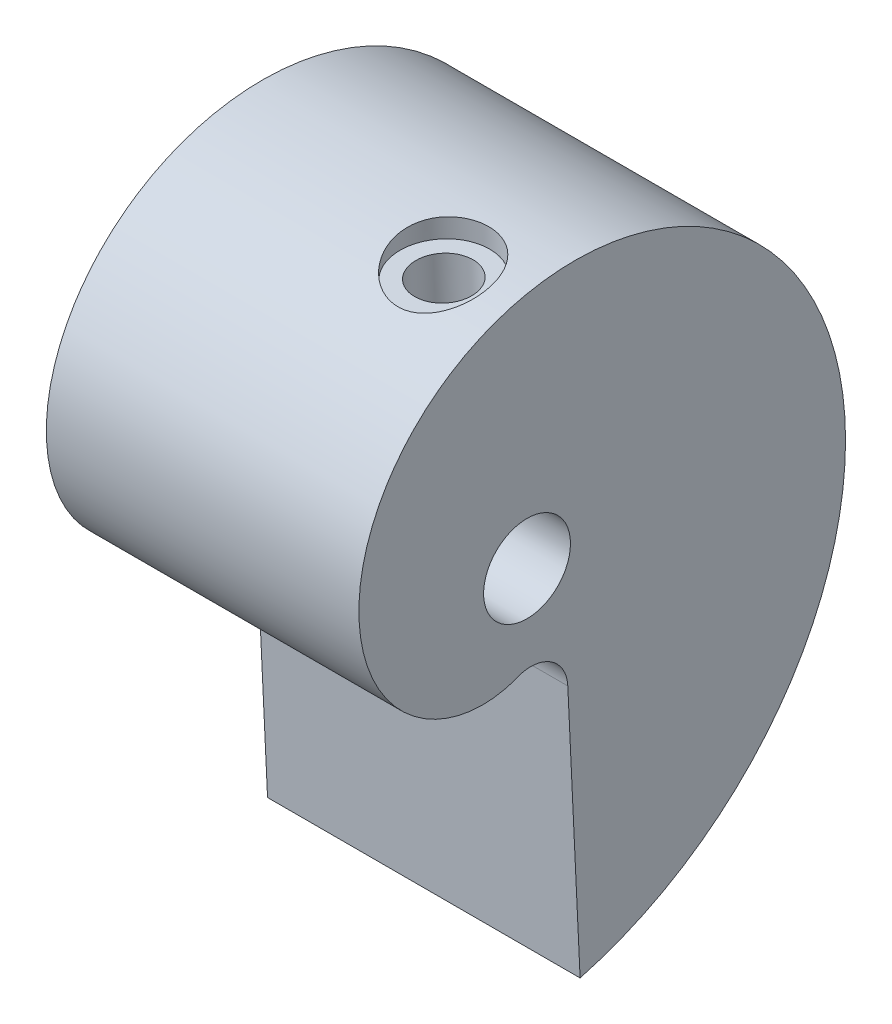
ISO-10303-21;
HEADER;
FILE_DESCRIPTION(('STEP AP214'),'2;1');
FILE_NAME('part.step','',(''),(''),'','','');
FILE_SCHEMA(('AUTOMOTIVE_DESIGN { 1 0 10303 214 1 1 1 1 }'));
ENDSEC;
DATA;
#1=APPLICATION_CONTEXT('core data for automotive mechanical design processes');
#2=APPLICATION_PROTOCOL_DEFINITION('international standard','automotive_design',2000,#1);
#3=PRODUCT_CONTEXT('',#1,'mechanical');
#4=PRODUCT('Part','Part','',(#3));
#5=PRODUCT_RELATED_PRODUCT_CATEGORY('part','',(#4));
#6=PRODUCT_DEFINITION_FORMATION('','',#4);
#7=PRODUCT_DEFINITION_CONTEXT('part definition',#1,'design');
#8=PRODUCT_DEFINITION('design','',#6,#7);
#9=PRODUCT_DEFINITION_SHAPE('','',#8);
#10=(LENGTH_UNIT() NAMED_UNIT(*) SI_UNIT(.MILLI.,.METRE.));
#11=(NAMED_UNIT(*) PLANE_ANGLE_UNIT() SI_UNIT($,.RADIAN.));
#12=(NAMED_UNIT(*) SI_UNIT($,.STERADIAN.) SOLID_ANGLE_UNIT());
#13=UNCERTAINTY_MEASURE_WITH_UNIT(LENGTH_MEASURE(1.E-05),#10,'distance_accuracy_value','');
#14=(GEOMETRIC_REPRESENTATION_CONTEXT(3) GLOBAL_UNCERTAINTY_ASSIGNED_CONTEXT((#13)) GLOBAL_UNIT_ASSIGNED_CONTEXT((#10,
#11,#12)) REPRESENTATION_CONTEXT('',''));
#15=CARTESIAN_POINT('',(0.,0.,0.));
#16=DIRECTION('',(0.,0.,1.));
#17=DIRECTION('',(1.,0.,0.));
#18=AXIS2_PLACEMENT_3D('',#15,#16,#17);
#19=CARTESIAN_POINT('',(21.59,16.3980040897592,0.208936694079273));
#20=DIRECTION('',(1.,0.,0.));
#21=DIRECTION('',(0.,0.,-1.));
#22=AXIS2_PLACEMENT_3D('',#19,#20,#21);
#23=PLANE('',#22);
#24=CARTESIAN_POINT('',(21.59,-26.3254834999288,-3.66701312597946));
#25=CARTESIAN_POINT('',(21.59,-25.8850164099486,-5.29183143138332));
#26=CARTESIAN_POINT('',(21.59,-25.2937709802203,-6.85500985861185));
#27=CARTESIAN_POINT('',(21.59,-23.8451939849136,-9.80629411018198));
#28=CARTESIAN_POINT('',(21.59,-22.9879265697091,-11.1943493778112));
#29=CARTESIAN_POINT('',(21.59,-21.0514010056648,-13.7523524342122));
#30=CARTESIAN_POINT('',(21.59,-19.9722145165317,-14.9222640436458));
#31=CARTESIAN_POINT('',(21.59,-17.6424148443339,-17.0111362692066));
#32=CARTESIAN_POINT('',(21.59,-16.3918777440894,-17.9300760548234));
#33=CARTESIAN_POINT('',(21.59,-13.774181132005,-19.4952108297215));
#34=CARTESIAN_POINT('',(21.59,-12.4070989510175,-20.1414006679111));
#35=CARTESIAN_POINT('',(21.59,-9.61304301680638,-21.1506818581234));
#36=CARTESIAN_POINT('',(21.59,-8.18614470800054,-21.5137834309209));
#37=CARTESIAN_POINT('',(21.59,-5.3288100875924,-21.9578966574969));
#38=CARTESIAN_POINT('',(21.59,-3.8984443651538,-22.038932986476));
#39=CARTESIAN_POINT('',(21.59,-1.08794928189315,-21.9307589450492));
#40=CARTESIAN_POINT('',(21.59,0.292117032528461,-21.7415862291151));
#41=CARTESIAN_POINT('',(21.59,2.95283289615589,-21.1147307327981));
#42=CARTESIAN_POINT('',(21.59,4.23342924609723,-20.6770966268396));
#43=CARTESIAN_POINT('',(21.59,6.65237105198453,-19.5836453555955));
#44=CARTESIAN_POINT('',(21.59,7.79067499289227,-18.9278855327687));
#45=CARTESIAN_POINT('',(21.59,9.88997156551444,-17.4355003933537));
#46=CARTESIAN_POINT('',(21.59,10.8509356728284,-16.5989384482919));
#47=CARTESIAN_POINT('',(21.59,12.5693210600784,-14.7874359048066));
#48=CARTESIAN_POINT('',(21.59,13.3267275415238,-13.8125618959728));
#49=CARTESIAN_POINT('',(21.59,14.6212472227952,-11.7701307863269));
#50=CARTESIAN_POINT('',(21.59,15.1583594978757,-10.7026406297588));
#51=CARTESIAN_POINT('',(21.59,16.0052572395325,-8.52186727257846));
#52=CARTESIAN_POINT('',(21.59,16.3150552236039,-7.40864857435838));
#53=CARTESIAN_POINT('',(21.59,16.7098316537026,-5.1825201174866));
#54=CARTESIAN_POINT('',(21.59,16.7948350803545,-4.06966980389498));
#55=CARTESIAN_POINT('',(21.59,16.7515036458065,-1.88772278855217));
#56=CARTESIAN_POINT('',(21.59,16.6232047553048,-0.818678144435623));
#57=CARTESIAN_POINT('',(21.59,16.1728034242135,1.23655153259428));
#58=CARTESIAN_POINT('',(21.59,15.8507460504129,2.22269384951727));
#59=CARTESIAN_POINT('',(21.59,15.0391926205608,4.07878041726697));
#60=CARTESIAN_POINT('',(21.59,14.5497485015278,4.94869279896394));
#61=CARTESIAN_POINT('',(21.59,13.4351525169527,6.5458728071125));
#62=CARTESIAN_POINT('',(21.59,12.8100570020662,7.27312041446994));
#63=CARTESIAN_POINT('',(21.59,11.4596211058448,8.56619770795014));
#64=CARTESIAN_POINT('',(21.59,10.7343389103516,9.13201969506656));
#65=CARTESIAN_POINT('',(21.59,8.46432492032774,10.5713349527582));
#66=CARTESIAN_POINT('',(21.59,6.82631034463374,11.1827796887629));
#67=CARTESIAN_POINT('',(21.59,3.59680348317033,11.7204279571445));
#68=CARTESIAN_POINT('',(21.59,2.00685947245538,11.6474809761802));
#69=CARTESIAN_POINT('',(21.59,-0.874358563474903,10.9424993264994));
#70=CARTESIAN_POINT('',(21.59,-2.16461256267651,10.3118298030999));
#71=CARTESIAN_POINT('',(21.59,-4.28109326467022,8.69840573541426));
#72=CARTESIAN_POINT('',(21.59,-5.10697539238301,7.71726162806799));
#73=CARTESIAN_POINT('',(21.59,-6.23707693613607,5.64499605846387));
#74=CARTESIAN_POINT('',(21.59,-6.54165034000696,4.55542957813348));
#75=CARTESIAN_POINT('',(21.59,-6.67904709626705,2.49487199667444));
#76=CARTESIAN_POINT('',(21.59,-6.51282232630776,1.52510200770759));
#77=CARTESIAN_POINT('',(21.59,-6.17940617515592,0.700777065763977));
#78=B_SPLINE_CURVE_WITH_KNOTS('',3,(#24,#25,#26,#27,#28,#29,#30,#31,#32,#33,#34,#35,#36,#37,#38,
#39,#40,#41,#42,#43,#44,#45,#46,#47,#48,#49,#50,#51,#52,#53,#54,#55,#56,#57,#58,#59,#60,#61,#62,
#63,#64,#65,#66,#67,#68,#69,#70,#71,#72,#73,#74,#75,#76,#77),.UNSPECIFIED.,.F.,.F.,(4,2,2,2,2,2,
2,2,2,2,2,2,2,2,2,2,2,2,2,2,2,2,2,2,2,2,4),(0.,0.0312500000000001,0.0625000000000001,
0.0937500000000002,0.125,0.15625,0.1875,0.218750000000001,0.250000000000001,0.281250000000001,
0.312500000000001,0.343750000000001,0.375000000000001,0.406250000000001,0.437500000000001,
0.468750000000001,0.500000000000001,0.53125,0.5625,0.59375,0.625,0.6875,0.75,0.8125,0.875,
0.9375,1.),.UNSPECIFIED.);
#79=CARTESIAN_POINT('',(21.59,-26.3254834999288,-3.66701312597946));
#80=VERTEX_POINT('',#79);
#81=CARTESIAN_POINT('',(21.59,-6.17940617515592,0.700777065763977));
#82=VERTEX_POINT('',#81);
#83=EDGE_CURVE('E96',#80,#82,#78,.T.);
#84=ORIENTED_EDGE('',*,*,#83,.T.);
#85=CARTESIAN_POINT('',(21.59,-8.55278837318837,-0.259188983321581));
#86=DIRECTION('',(-1.,0.,0.));
#87=DIRECTION('',(0.,0.,-1.));
#88=AXIS2_PLACEMENT_3D('',#85,#86,#87);
#89=CIRCLE('',#88,2.56017145389411);
#90=CARTESIAN_POINT('',(21.59,-8.4312368938815,-2.81647330682036));
#91=VERTEX_POINT('',#90);
#92=EDGE_CURVE('E92',#82,#91,#89,.T.);
#93=ORIENTED_EDGE('',*,*,#92,.T.);
#94=DIRECTION('',(0.,-0.998872290216758,-0.0474778668131734));
#95=VECTOR('',#94,1.);
#96=CARTESIAN_POINT('',(21.59,-26.3254834999288,-3.66701312597946));
#97=LINE('',#96,#95);
#98=EDGE_CURVE('E72',#91,#80,#97,.T.);
#99=ORIENTED_EDGE('',*,*,#98,.T.);
#100=EDGE_LOOP('',(#84,#93,#99));
#101=FACE_BOUND('',#100,.T.);
#102=CARTESIAN_POINT('',(21.59,0.,0.));
#103=DIRECTION('',(1.,0.,0.));
#104=DIRECTION('',(0.,0.,-1.));
#105=AXIS2_PLACEMENT_3D('',#102,#103,#104);
#106=CIRCLE('',#105,3.);
#107=CARTESIAN_POINT('',(21.59,0.,-3.));
#108=VERTEX_POINT('',#107);
#109=EDGE_CURVE('E105',#108,#108,#106,.T.);
#110=ORIENTED_EDGE('',*,*,#109,.F.);
#111=EDGE_LOOP('',(#110));
#112=FACE_BOUND('',#111,.T.);
#113=ADVANCED_FACE('F47',(#101,#112),#23,.T.);
#114=CARTESIAN_POINT('',(0.,16.3980040897592,0.208936694079273));
#115=DIRECTION('',(1.,0.,0.));
#116=DIRECTION('',(0.,0.,-1.));
#117=AXIS2_PLACEMENT_3D('',#114,#115,#116);
#118=PLANE('',#117);
#119=CARTESIAN_POINT('',(0.,-26.3254834999288,-3.66701312597946));
#120=CARTESIAN_POINT('',(0.,-25.8850164099486,-5.29183143138332));
#121=CARTESIAN_POINT('',(0.,-25.2937709802203,-6.85500985861185));
#122=CARTESIAN_POINT('',(0.,-23.8451939849136,-9.80629411018198));
#123=CARTESIAN_POINT('',(0.,-22.9879265697091,-11.1943493778112));
#124=CARTESIAN_POINT('',(0.,-21.0514010056648,-13.7523524342122));
#125=CARTESIAN_POINT('',(0.,-19.9722145165317,-14.9222640436458));
#126=CARTESIAN_POINT('',(0.,-17.6424148443339,-17.0111362692066));
#127=CARTESIAN_POINT('',(0.,-16.3918777440894,-17.9300760548234));
#128=CARTESIAN_POINT('',(0.,-13.774181132005,-19.4952108297215));
#129=CARTESIAN_POINT('',(0.,-12.4070989510175,-20.1414006679111));
#130=CARTESIAN_POINT('',(0.,-9.61304301680638,-21.1506818581234));
#131=CARTESIAN_POINT('',(0.,-8.18614470800054,-21.5137834309209));
#132=CARTESIAN_POINT('',(0.,-5.3288100875924,-21.9578966574969));
#133=CARTESIAN_POINT('',(0.,-3.8984443651538,-22.038932986476));
#134=CARTESIAN_POINT('',(0.,-1.08794928189315,-21.9307589450492));
#135=CARTESIAN_POINT('',(0.,0.292117032528461,-21.7415862291151));
#136=CARTESIAN_POINT('',(0.,2.95283289615589,-21.1147307327981));
#137=CARTESIAN_POINT('',(0.,4.23342924609723,-20.6770966268396));
#138=CARTESIAN_POINT('',(0.,6.65237105198453,-19.5836453555955));
#139=CARTESIAN_POINT('',(0.,7.79067499289227,-18.9278855327687));
#140=CARTESIAN_POINT('',(0.,9.88997156551444,-17.4355003933537));
#141=CARTESIAN_POINT('',(0.,10.8509356728284,-16.5989384482919));
#142=CARTESIAN_POINT('',(0.,12.5693210600784,-14.7874359048066));
#143=CARTESIAN_POINT('',(0.,13.3267275415238,-13.8125618959728));
#144=CARTESIAN_POINT('',(0.,14.6212472227952,-11.7701307863269));
#145=CARTESIAN_POINT('',(0.,15.1583594978757,-10.7026406297588));
#146=CARTESIAN_POINT('',(0.,16.0052572395325,-8.52186727257846));
#147=CARTESIAN_POINT('',(0.,16.3150552236039,-7.40864857435838));
#148=CARTESIAN_POINT('',(0.,16.7098316537026,-5.1825201174866));
#149=CARTESIAN_POINT('',(0.,16.7948350803545,-4.06966980389498));
#150=CARTESIAN_POINT('',(0.,16.7515036458065,-1.88772278855217));
#151=CARTESIAN_POINT('',(0.,16.6232047553048,-0.818678144435623));
#152=CARTESIAN_POINT('',(0.,16.1728034242135,1.23655153259428));
#153=CARTESIAN_POINT('',(0.,15.8507460504129,2.22269384951727));
#154=CARTESIAN_POINT('',(0.,15.0391926205608,4.07878041726697));
#155=CARTESIAN_POINT('',(0.,14.5497485015278,4.94869279896394));
#156=CARTESIAN_POINT('',(0.,13.4351525169527,6.5458728071125));
#157=CARTESIAN_POINT('',(0.,12.8100570020662,7.27312041446994));
#158=CARTESIAN_POINT('',(0.,11.4596211058448,8.56619770795014));
#159=CARTESIAN_POINT('',(0.,10.7343389103516,9.13201969506656));
#160=CARTESIAN_POINT('',(0.,8.46432492032774,10.5713349527582));
#161=CARTESIAN_POINT('',(0.,6.82631034463374,11.1827796887629));
#162=CARTESIAN_POINT('',(0.,3.59680348317033,11.7204279571445));
#163=CARTESIAN_POINT('',(0.,2.00685947245538,11.6474809761802));
#164=CARTESIAN_POINT('',(0.,-0.874358563474903,10.9424993264994));
#165=CARTESIAN_POINT('',(0.,-2.16461256267651,10.3118298030999));
#166=CARTESIAN_POINT('',(0.,-4.28109326467022,8.69840573541426));
#167=CARTESIAN_POINT('',(0.,-5.10697539238301,7.71726162806799));
#168=CARTESIAN_POINT('',(0.,-6.23707693613607,5.64499605846387));
#169=CARTESIAN_POINT('',(0.,-6.54165034000696,4.55542957813348));
#170=CARTESIAN_POINT('',(0.,-6.67904709626705,2.49487199667444));
#171=CARTESIAN_POINT('',(0.,-6.51282232630776,1.52510200770759));
#172=CARTESIAN_POINT('',(0.,-6.17940617515592,0.700777065763977));
#173=B_SPLINE_CURVE_WITH_KNOTS('',3,(#119,#120,#121,#122,#123,#124,#125,#126,#127,#128,#129,
#130,#131,#132,#133,#134,#135,#136,#137,#138,#139,#140,#141,#142,#143,#144,#145,#146,#147,#148,
#149,#150,#151,#152,#153,#154,#155,#156,#157,#158,#159,#160,#161,#162,#163,#164,#165,#166,#167,
#168,#169,#170,#171,#172),.UNSPECIFIED.,.F.,.F.,(4,2,2,2,2,2,2,2,2,2,2,2,2,2,2,2,2,2,2,2,2,2,2,
2,2,2,4),(0.,0.0312500000000001,0.0625000000000001,0.0937500000000002,0.125,0.15625,0.1875,
0.218750000000001,0.250000000000001,0.281250000000001,0.312500000000001,0.343750000000001,
0.375000000000001,0.406250000000001,0.437500000000001,0.468750000000001,0.500000000000001,
0.53125,0.5625,0.59375,0.625,0.6875,0.75,0.8125,0.875,0.9375,1.),.UNSPECIFIED.);
#174=CARTESIAN_POINT('',(0.,-26.3254834999288,-3.66701312597946));
#175=VERTEX_POINT('',#174);
#176=CARTESIAN_POINT('',(0.,-6.17940617515592,0.700777065763977));
#177=VERTEX_POINT('',#176);
#178=EDGE_CURVE('E102',#175,#177,#173,.T.);
#179=ORIENTED_EDGE('',*,*,#178,.F.);
#180=DIRECTION('',(0.,-0.998872290216758,-0.0474778668131734));
#181=VECTOR('',#180,1.);
#182=CARTESIAN_POINT('',(0.,-26.3254834999288,-3.66701312597946));
#183=LINE('',#182,#181);
#184=CARTESIAN_POINT('',(0.,-8.4312368938815,-2.81647330682036));
#185=VERTEX_POINT('',#184);
#186=EDGE_CURVE('E89',#185,#175,#183,.T.);
#187=ORIENTED_EDGE('',*,*,#186,.F.);
#188=CARTESIAN_POINT('',(0.,-8.55278837318837,-0.259188983321581));
#189=DIRECTION('',(-1.,0.,0.));
#190=DIRECTION('',(0.,0.,-1.));
#191=AXIS2_PLACEMENT_3D('',#188,#189,#190);
#192=CIRCLE('',#191,2.56017145389411);
#193=EDGE_CURVE('E84',#177,#185,#192,.T.);
#194=ORIENTED_EDGE('',*,*,#193,.F.);
#195=EDGE_LOOP('',(#179,#187,#194));
#196=FACE_BOUND('',#195,.T.);
#197=CARTESIAN_POINT('',(0.,0.,0.));
#198=DIRECTION('',(1.,0.,0.));
#199=DIRECTION('',(0.,0.,-1.));
#200=AXIS2_PLACEMENT_3D('',#197,#198,#199);
#201=CIRCLE('',#200,3.);
#202=CARTESIAN_POINT('',(0.,0.,-3.));
#203=VERTEX_POINT('',#202);
#204=EDGE_CURVE('E109',#203,#203,#201,.T.);
#205=ORIENTED_EDGE('',*,*,#204,.T.);
#206=EDGE_LOOP('',(#205));
#207=FACE_BOUND('',#206,.T.);
#208=ADVANCED_FACE('F140',(#196,#207),#118,.F.);
#209=DIRECTION('',(-1.,0.,0.));
#210=VECTOR('',#209,1.);
#211=SURFACE_OF_LINEAR_EXTRUSION('',#78,#210);
#212=CARTESIAN_POINT('',(16.565,16.7506396740937,-2.38240201858189));
#213=CARTESIAN_POINT('',(16.7433125657749,16.7506413895993,-2.38239572343409));
#214=CARTESIAN_POINT('',(16.9217084574211,16.749821870359,-2.36735698221768));
#215=CARTESIAN_POINT('',(17.2735404531971,16.7463257784659,-2.30760094349494));
#216=CARTESIAN_POINT('',(17.4469725353157,16.7436477419284,-2.26286025207603));
#217=CARTESIAN_POINT('',(17.7838175619757,16.7358008377302,-2.14500470832748));
#218=CARTESIAN_POINT('',(17.9472329710051,16.7306325855541,-2.07189686812296));
#219=CARTESIAN_POINT('',(18.2593967109722,16.7168613322798,-1.89946022909936));
#220=CARTESIAN_POINT('',(18.4081474456539,16.7082588952634,-1.80013573740177));
#221=CARTESIAN_POINT('',(18.6865194273289,16.6865245866847,-1.57839471352308));
#222=CARTESIAN_POINT('',(18.816172777858,16.6734004432769,-1.45601774158622));
#223=CARTESIAN_POINT('',(19.0529395131531,16.6415294219983,-1.19174783860988));
#224=CARTESIAN_POINT('',(19.1600538561791,16.6227827832536,-1.04985573769259));
#225=CARTESIAN_POINT('',(19.348142330831,16.5789328491663,-0.751848833363511));
#226=CARTESIAN_POINT('',(19.4292768024721,16.5538703203621,-0.595829205294695));
#227=CARTESIAN_POINT('',(19.5642185684297,16.4968714939526,-0.273578315973267));
#228=CARTESIAN_POINT('',(19.6180270069779,16.4649354842426,-0.107347482624563));
#229=CARTESIAN_POINT('',(19.6971716405541,16.394258927079,0.23027529592253));
#230=CARTESIAN_POINT('',(19.722518372012,16.3555209038536,0.401665307067589));
#231=CARTESIAN_POINT('',(19.744621054064,16.2718922700363,0.74477200769912));
#232=CARTESIAN_POINT('',(19.7413740122333,16.2270010159743,0.916488729496723));
#233=CARTESIAN_POINT('',(19.7065779354297,16.131231758128,1.25944455369324));
#234=CARTESIAN_POINT('',(19.6744043268891,16.0802432751121,1.43058903606567));
#235=CARTESIAN_POINT('',(19.5822767862168,15.9748963486612,1.76413828861456));
#236=CARTESIAN_POINT('',(19.5223164634281,15.9205371324849,1.92654103868751));
#237=CARTESIAN_POINT('',(19.37349122948,15.8084495214842,2.24504073687003));
#238=CARTESIAN_POINT('',(19.2835681169074,15.7506732515505,2.40062724447312));
#239=CARTESIAN_POINT('',(19.0779746661179,15.6367051121502,2.69441582491913));
#240=CARTESIAN_POINT('',(18.9622977115638,15.5805136540196,2.83261341612553));
#241=CARTESIAN_POINT('',(18.7052597507176,15.4718331439367,3.09055875271198));
#242=CARTESIAN_POINT('',(18.563448220764,15.4194359017119,3.20990127896187));
#243=CARTESIAN_POINT('',(18.3354405886196,15.3473231379403,3.3696794962394));
#244=CARTESIAN_POINT('',(18.2568465828785,15.324356219765,3.419753165804));
#245=CARTESIAN_POINT('',(18.0950375543645,15.2810258558235,3.51306824531798));
#246=CARTESIAN_POINT('',(18.0118248362869,15.2606611280454,3.55631302212939));
#247=CARTESIAN_POINT('',(17.8449506674736,15.2237661173167,3.63386819559383));
#248=CARTESIAN_POINT('',(17.7614559986682,15.2071103843645,3.66847836816939));
#249=CARTESIAN_POINT('',(17.5913768396874,15.1769484403086,3.73067224852883));
#250=CARTESIAN_POINT('',(17.5047938330402,15.1634407398821,3.75825927950836));
#251=CARTESIAN_POINT('',(17.3291969657523,15.1398794833412,3.80610837444833));
#252=CARTESIAN_POINT('',(17.2401839282174,15.1298247729152,3.82637288639648));
#253=CARTESIAN_POINT('',(17.0604349726318,15.113407621694,3.85934439959767));
#254=CARTESIAN_POINT('',(16.9696991833952,15.1070449059538,3.87205196362262));
#255=CARTESIAN_POINT('',(16.79455331826,15.0985240892335,3.88904578045354));
#256=CARTESIAN_POINT('',(16.7102142050666,15.0960717840662,3.89392151576271));
#257=CARTESIAN_POINT('',(16.5413523279664,15.0944819837441,3.89708380613252));
#258=CARTESIAN_POINT('',(16.4568295124437,15.0953455878203,3.89536817614142));
#259=CARTESIAN_POINT('',(16.2883132554156,15.1003719089667,3.88536114739973));
#260=CARTESIAN_POINT('',(16.2043195602008,15.1045329006177,3.87707318774104));
#261=CARTESIAN_POINT('',(16.0374380848698,15.1160570440926,3.85402351718646));
#262=CARTESIAN_POINT('',(15.9545507303056,15.1234213934655,3.83925938520938));
#263=CARTESIAN_POINT('',(15.7135282259701,15.1495616401689,3.78655914799319));
#264=CARTESIAN_POINT('',(15.5576580863421,15.1725644974324,3.73987333526958));
#265=CARTESIAN_POINT('',(15.2563374938122,15.2283883617697,3.6243856032296));
#266=CARTESIAN_POINT('',(15.1108890695337,15.2612112739511,3.55557939232458));
#267=CARTESIAN_POINT('',(14.8265360489511,15.3363613688962,3.39404776600376));
#268=CARTESIAN_POINT('',(14.6883111815686,15.3790784167601,3.30030741267247));
#269=CARTESIAN_POINT('',(14.4294546693891,15.4703504029779,3.09340467821784));
#270=CARTESIAN_POINT('',(14.3088294301683,15.5189074551929,2.98023525813181));
#271=CARTESIAN_POINT('',(14.0789724060991,15.6231462990422,2.72781772189997));
#272=CARTESIAN_POINT('',(13.9713199073631,15.6790889471381,2.58723636566584));
#273=CARTESIAN_POINT('',(13.7815053033552,15.7918180971415,2.29008118723744));
#274=CARTESIAN_POINT('',(13.6993495787082,15.8486048065575,2.13350337490384));
#275=CARTESIAN_POINT('',(13.5602533042469,15.9623970325448,1.80219910865936));
#276=CARTESIAN_POINT('',(13.504326409703,16.0193369007987,1.62702235329759));
#277=CARTESIAN_POINT('',(13.4242595372715,16.1287696936005,1.26820289867208));
#278=CARTESIAN_POINT('',(13.4001155032531,16.1812631847952,1.0845612827911));
#279=CARTESIAN_POINT('',(13.385193870193,16.2787719932153,0.718254653214319));
#280=CARTESIAN_POINT('',(13.3936966228172,16.3239259866846,0.53565643838068));
#281=CARTESIAN_POINT('',(13.4429083099938,16.4069046087537,0.173155051099132));
#282=CARTESIAN_POINT('',(13.4836093005975,16.4447310423436,-0.00674877495434841));
#283=CARTESIAN_POINT('',(13.5942352875637,16.5112585207308,-0.350944470852365));
#284=CARTESIAN_POINT('',(13.662934134937,16.540262566406,-0.515572664111018));
#285=CARTESIAN_POINT('',(13.8276352586509,16.5913323509495,-0.831717074035169));
#286=CARTESIAN_POINT('',(13.9236341626166,16.6133989460922,-0.983234907209561));
#287=CARTESIAN_POINT('',(14.1382408076017,16.6509650936835,-1.26576374035269));
#288=CARTESIAN_POINT('',(14.2564004615726,16.6665779170517,-1.39710052998256));
#289=CARTESIAN_POINT('',(14.5131439312932,16.692803887894,-1.63864995249749));
#290=CARTESIAN_POINT('',(14.6517311068004,16.7034162117182,-1.74885910360258));
#291=CARTESIAN_POINT('',(14.9458446839421,16.7207600224453,-1.9451849781874));
#292=CARTESIAN_POINT('',(15.1014212227302,16.7274796324812,-2.03122756112737));
#293=CARTESIAN_POINT('',(15.4247138575761,16.7380174528368,-2.17622583051713));
#294=CARTESIAN_POINT('',(15.592420784005,16.7418378301567,-2.23520173460522));
#295=CARTESIAN_POINT('',(15.8944508944589,16.7467084225449,-2.31383530128008));
#296=CARTESIAN_POINT('',(16.0272363012907,16.7482011961144,-2.33950607055206));
#297=CARTESIAN_POINT('',(16.2949985372011,16.7501661752923,-2.37379186153075));
#298=CARTESIAN_POINT('',(16.429975378834,16.7506383750518,-2.38240678549186));
#299=CARTESIAN_POINT('',(16.565,16.7506396740937,-2.38240201858189));
#300=B_SPLINE_CURVE_WITH_KNOTS('',3,(#212,#213,#214,#215,#216,#217,#218,#219,#220,#221,#222,
#223,#224,#225,#226,#227,#228,#229,#230,#231,#232,#233,#234,#235,#236,#237,#238,#239,#240,#241,
#242,#243,#244,#245,#246,#247,#248,#249,#250,#251,#252,#253,#254,#255,#256,#257,#258,#259,#260,
#261,#262,#263,#264,#265,#266,#267,#268,#269,#270,#271,#272,#273,#274,#275,#276,#277,#278,#279,
#280,#281,#282,#283,#284,#285,#286,#287,#288,#289,#290,#291,#292,#293,#294,#295,#296,#297,#298,
#299),.UNSPECIFIED.,.T.,.F.,(4,2,2,2,2,2,2,2,2,2,2,2,2,2,2,2,2,2,2,2,2,2,2,2,2,2,2,2,2,2,2,2,2,
2,2,2,2,2,2,2,2,2,2,4),(0.,0.534451645894367,1.06932473792822,1.60406569789057,2.13871886013215,
2.67246273028415,3.2061839033957,3.73654461265796,4.26688311212229,4.79702521723493,
5.32722280398093,5.86915066299671,6.41120322172103,6.97489189795413,7.5387255570959,
8.11338569897889,8.40100316382573,8.6884783783365,8.96383534701767,9.23906177966751,
9.51419611619283,9.78930996067973,10.0425392195921,10.295852431789,10.5490331806023,
10.8023086604135,11.2929022099079,11.7835909971805,12.2985553916675,12.8137067479945,
13.3682975128205,13.9230269535227,14.497716588367,15.0723328741687,15.6343561150362,
16.1962407367653,16.7357872484509,17.2752671389078,17.8048292042514,18.3344784651681,
18.8657353155608,19.3965946916137,19.8012981803549,20.2060039884107),.UNSPECIFIED.);
#301=CARTESIAN_POINT('',(16.565,16.7506396740937,-2.38240201858189));
#302=VERTEX_POINT('',#301);
#303=EDGE_CURVE('E120',#302,#302,#300,.T.);
#304=ORIENTED_EDGE('',*,*,#303,.T.);
#305=EDGE_LOOP('',(#304));
#306=FACE_BOUND('',#305,.T.);
#307=ORIENTED_EDGE('',*,*,#178,.T.);
#308=DIRECTION('',(-1.,0.,0.));
#309=VECTOR('',#308,1.);
#310=CARTESIAN_POINT('',(21.59,-6.17940617515592,0.700777065763977));
#311=LINE('',#310,#309);
#312=EDGE_CURVE('E13',#82,#177,#311,.T.);
#313=ORIENTED_EDGE('',*,*,#312,.F.);
#314=ORIENTED_EDGE('',*,*,#83,.F.);
#315=DIRECTION('',(-1.,0.,0.));
#316=VECTOR('',#315,1.);
#317=CARTESIAN_POINT('',(21.59,-26.3254834999288,-3.66701312597946));
#318=LINE('',#317,#316);
#319=EDGE_CURVE('E103',#80,#175,#318,.T.);
#320=ORIENTED_EDGE('',*,*,#319,.T.);
#321=EDGE_LOOP('',(#307,#313,#314,#320));
#322=FACE_BOUND('',#321,.T.);
#323=ADVANCED_FACE('F49',(#306,#322),#211,.F.);
#324=CARTESIAN_POINT('',(21.59,-8.55278837318837,-0.259188983321581));
#325=DIRECTION('',(-1.,0.,0.));
#326=DIRECTION('',(0.,0.,1.));
#327=AXIS2_PLACEMENT_3D('',#324,#325,#326);
#328=CYLINDRICAL_SURFACE('',#327,2.56017145389411);
#329=ORIENTED_EDGE('',*,*,#193,.T.);
#330=DIRECTION('',(-1.,0.,0.));
#331=VECTOR('',#330,1.);
#332=CARTESIAN_POINT('',(21.59,-8.4312368938815,-2.81647330682036));
#333=LINE('',#332,#331);
#334=EDGE_CURVE('E63',#91,#185,#333,.T.);
#335=ORIENTED_EDGE('',*,*,#334,.F.);
#336=ORIENTED_EDGE('',*,*,#92,.F.);
#337=ORIENTED_EDGE('',*,*,#312,.T.);
#338=EDGE_LOOP('',(#329,#335,#336,#337));
#339=FACE_BOUND('',#338,.T.);
#340=ADVANCED_FACE('F93',(#339),#328,.F.);
#341=CARTESIAN_POINT('',(21.59,-26.3254834999288,-3.66701312597946));
#342=DIRECTION('',(0.,0.0474778668131734,-0.998872290216758));
#343=DIRECTION('',(0.,0.998872290216758,0.0474778668131734));
#344=AXIS2_PLACEMENT_3D('',#341,#342,#343);
#345=PLANE('',#344);
#346=ORIENTED_EDGE('',*,*,#186,.T.);
#347=ORIENTED_EDGE('',*,*,#319,.F.);
#348=ORIENTED_EDGE('',*,*,#98,.F.);
#349=ORIENTED_EDGE('',*,*,#334,.T.);
#350=EDGE_LOOP('',(#346,#347,#348,#349));
#351=FACE_BOUND('',#350,.T.);
#352=ADVANCED_FACE('F136',(#351),#345,.F.);
#353=CARTESIAN_POINT('',(21.59,0.,0.));
#354=DIRECTION('',(-1.,0.,0.));
#355=DIRECTION('',(0.,0.,1.));
#356=AXIS2_PLACEMENT_3D('',#353,#354,#355);
#357=CYLINDRICAL_SURFACE('',#356,3.);
#358=CARTESIAN_POINT('',(16.565,2.12028038204539,2.12235979549027));
#359=CARTESIAN_POINT('',(16.4667328598408,2.12028848918387,2.12235574640076));
#360=CARTESIAN_POINT('',(16.3684396592825,2.1272670071276,2.11544854411303));
#361=CARTESIAN_POINT('',(16.1753956042412,2.15382911691391,2.08838492945829));
#362=CARTESIAN_POINT('',(16.0806515368345,2.17343567338187,2.06820437751953));
#363=CARTESIAN_POINT('',(15.898115540295,2.22182310173142,2.01611940184166));
#364=CARTESIAN_POINT('',(15.8102646347584,2.25051228608712,1.98433167860404));
#365=CARTESIAN_POINT('',(15.641517994946,2.31379446378661,1.91016493745002));
#366=CARTESIAN_POINT('',(15.5606235348317,2.34838853523675,1.86778398477872));
#367=CARTESIAN_POINT('',(15.3939764145017,2.42634419581015,1.76567376420376));
#368=CARTESIAN_POINT('',(15.3095005764119,2.47022479874889,1.70425677328391));
#369=CARTESIAN_POINT('',(15.1512681262757,2.55831415648357,1.56893677481746));
#370=CARTESIAN_POINT('',(15.0775234546584,2.60252322014981,1.49502005366528));
#371=CARTESIAN_POINT('',(14.9319381685596,2.69434111659312,1.32338517364023));
#372=CARTESIAN_POINT('',(14.8620133455484,2.74147712399974,1.22376200962438));
#373=CARTESIAN_POINT('',(14.74092456293,2.82705144975862,1.01040221396569));
#374=CARTESIAN_POINT('',(14.6897263388148,2.86550560364039,0.896691873719948));
#375=CARTESIAN_POINT('',(14.6194406320562,2.92138993541408,0.688486460837517));
#376=CARTESIAN_POINT('',(14.5955107790667,2.94167661806749,0.596380838870983));
#377=CARTESIAN_POINT('',(14.5610706488714,2.97361755963886,0.408255826934818));
#378=CARTESIAN_POINT('',(14.5505501907331,2.9852783648312,0.312239463380161));
#379=CARTESIAN_POINT('',(14.5435070950218,2.99921453700448,0.118857670982175));
#380=CARTESIAN_POINT('',(14.5470072123757,3.00147463482578,0.0214903048783748));
#381=CARTESIAN_POINT('',(14.5678489053777,2.99664936371328,-0.17151864443503));
#382=CARTESIAN_POINT('',(14.5851945804805,2.98956122650674,-0.267159707935345));
#383=CARTESIAN_POINT('',(14.6323848829118,2.96712722760512,-0.452468583282783));
#384=CARTESIAN_POINT('',(14.6620100738361,2.95192505613619,-0.542210701604359));
#385=CARTESIAN_POINT('',(14.7324642390206,2.91474396742281,-0.715642458400003));
#386=CARTESIAN_POINT('',(14.7732953323774,2.89276376831946,-0.799330948314167));
#387=CARTESIAN_POINT('',(14.8700346253892,2.84090881378539,-0.968460757395492));
#388=CARTESIAN_POINT('',(14.9271235396893,2.81042345250388,-1.05303628307403));
#389=CARTESIAN_POINT('',(15.052107400767,2.74554521098295,-1.21218164141393));
#390=CARTESIAN_POINT('',(15.1200150156509,2.71114776358468,-1.28673955296214));
#391=CARTESIAN_POINT('',(15.27764346291,2.63524990882614,-1.43652944196565));
#392=CARTESIAN_POINT('',(15.3691138068383,2.59351953387313,-1.50981173568687));
#393=CARTESIAN_POINT('',(15.5641707375766,2.51308481925863,-1.64020286542295));
#394=CARTESIAN_POINT('',(15.6677497479923,2.47437861240433,-1.69732173916104));
#395=CARTESIAN_POINT('',(15.8599239808636,2.41399774725226,-1.78175338308866));
#396=CARTESIAN_POINT('',(15.9462288128377,2.39046162805908,-1.81292374997662));
#397=CARTESIAN_POINT('',(16.1239987409443,2.35152611340619,-1.8631546249348));
#398=CARTESIAN_POINT('',(16.2154541774374,2.33611201342263,-1.88223703043339));
#399=CARTESIAN_POINT('',(16.4021128112496,2.31584458356228,-1.90712969037207));
#400=CARTESIAN_POINT('',(16.4973395024567,2.31107375592379,-1.91283627813399));
#401=CARTESIAN_POINT('',(16.6874607323001,2.31329557478279,-1.91014793487933));
#402=CARTESIAN_POINT('',(16.7823552399239,2.32028929172951,-1.90175172065692));
#403=CARTESIAN_POINT('',(16.9586160296345,2.34336147118843,-1.87321469247652));
#404=CARTESIAN_POINT('',(17.0403497189188,2.35839780834755,-1.85441386383909));
#405=CARTESIAN_POINT('',(17.19949554989,2.39480473578163,-1.80715213868883));
#406=CARTESIAN_POINT('',(17.2769037521532,2.41618099187566,-1.7786825981863));
#407=CARTESIAN_POINT('',(17.4600051025368,2.47361894198719,-1.69840930630491));
#408=CARTESIAN_POINT('',(17.5629020560131,2.51197680379099,-1.64186223169712));
#409=CARTESIAN_POINT('',(17.7568810771684,2.5917721464647,-1.51277668605855));
#410=CARTESIAN_POINT('',(17.8479411400979,2.63321514396262,-1.4402090897587));
#411=CARTESIAN_POINT('',(18.0181794819501,2.71500637650003,-1.2794467788588));
#412=CARTESIAN_POINT('',(18.0971907161838,2.75533380270867,-1.1910638892513));
#413=CARTESIAN_POINT('',(18.2400039987763,2.83003944321896,-1.00064909496542));
#414=CARTESIAN_POINT('',(18.3038304372846,2.86442717330891,-0.898639495086297));
#415=CARTESIAN_POINT('',(18.4039161810089,2.91809353527471,-0.702251992225361));
#416=CARTESIAN_POINT('',(18.4430670671926,2.93897614094036,-0.609789632069121));
#417=CARTESIAN_POINT('',(18.5078362764038,2.97220570414023,-0.418767233075192));
#418=CARTESIAN_POINT('',(18.5334633325463,2.98455817166969,-0.320211175344464));
#419=CARTESIAN_POINT('',(18.5698973317487,2.99933307232094,-0.119158499306343));
#420=CARTESIAN_POINT('',(18.5806363557601,3.0017100967523,-0.0166460005023574));
#421=CARTESIAN_POINT('',(18.5863803799619,2.99582780040363,0.188515646070649));
#422=CARTESIAN_POINT('',(18.5813879793598,2.98757023684507,0.291164768464989));
#423=CARTESIAN_POINT('',(18.5569878371614,2.96196684512782,0.485408367359834));
#424=CARTESIAN_POINT('',(18.5387107864744,2.94536370839101,0.57724819333632));
#425=CARTESIAN_POINT('',(18.4899650043451,2.90466382257784,0.755860162803804));
#426=CARTESIAN_POINT('',(18.4594943206658,2.88056587369737,0.842631492262873));
#427=CARTESIAN_POINT('',(18.3856377944098,2.82493697968474,1.01404855691689));
#428=CARTESIAN_POINT('',(18.3416360099734,2.79307122568373,1.09831760125453));
#429=CARTESIAN_POINT('',(18.2429253261677,2.72476102863076,1.25827469012518));
#430=CARTESIAN_POINT('',(18.1882103677206,2.68831399873056,1.33395784027541));
#431=CARTESIAN_POINT('',(18.0598992821813,2.60701572773753,1.48732606234674));
#432=CARTESIAN_POINT('',(17.9846856967384,2.56174675585185,1.56343617799662));
#433=CARTESIAN_POINT('',(17.8228381890138,2.47141451097108,1.7026452151688));
#434=CARTESIAN_POINT('',(17.7361950427309,2.42635143485822,1.76573352109393));
#435=CARTESIAN_POINT('',(17.5581723264889,2.34321746911373,1.87449071596821));
#436=CARTESIAN_POINT('',(17.4674353636179,2.30488489975618,1.92100682772764));
#437=CARTESIAN_POINT('',(17.2775170660789,2.23609615976015,2.00066258472564));
#438=CARTESIAN_POINT('',(17.1783512964321,2.20562587302337,2.03382626405166));
#439=CARTESIAN_POINT('',(16.9937200304283,2.16196405390712,2.08007731395641));
#440=CARTESIAN_POINT('',(16.9094667801936,2.14653840678831,2.09584962228186));
#441=CARTESIAN_POINT('',(16.7384806064526,2.12569838741478,2.11698704174864));
#442=CARTESIAN_POINT('',(16.651750458181,2.12027322504481,2.12236337003583));
#443=CARTESIAN_POINT('',(16.565,2.12028038204539,2.12235979549027));
#444=B_SPLINE_CURVE_WITH_KNOTS('',3,(#358,#359,#360,#361,#362,#363,#364,#365,#366,#367,#368,
#369,#370,#371,#372,#373,#374,#375,#376,#377,#378,#379,#380,#381,#382,#383,#384,#385,#386,#387,
#388,#389,#390,#391,#392,#393,#394,#395,#396,#397,#398,#399,#400,#401,#402,#403,#404,#405,#406,
#407,#408,#409,#410,#411,#412,#413,#414,#415,#416,#417,#418,#419,#420,#421,#422,#423,#424,#425,
#426,#427,#428,#429,#430,#431,#432,#433,#434,#435,#436,#437,#438,#439,#440,#441,#442,#443),
.UNSPECIFIED.,.T.,.F.,(4,2,2,2,2,2,2,2,2,2,2,2,2,2,2,2,2,2,2,2,2,2,2,2,2,2,2,2,2,2,2,2,2,2,2,2,
2,2,2,2,2,2,4),(0.,0.294403536380051,0.589343975595897,0.881397200780214,1.17350380579788,
1.51211387476107,1.85109787614565,2.24051778682945,2.62922155934116,2.91986353918583,
3.21028472066951,3.5011774368684,3.79215631384676,4.07814540042061,4.36418860638471,
4.68247532658299,5.00113752008124,5.37279099606919,5.7442131606791,6.02735164683166,
6.3099757476852,6.59478313131646,6.8796164308116,7.13424228210731,7.38909637504133,
7.7577000588713,8.12697946404345,8.50098664778866,8.87438897473934,9.18078287749256,
9.48697868121594,9.79456680098564,10.1021041025096,10.3861411287428,10.6702236483578,
10.9698648671405,11.2696760468771,11.6168834583152,11.9643728107566,12.2899631035632,
12.6149646923712,12.8751457033016,13.1350458248448),.UNSPECIFIED.);
#445=CARTESIAN_POINT('',(16.565,2.12028038204539,2.12235979549027));
#446=VERTEX_POINT('',#445);
#447=EDGE_CURVE('E53',#446,#446,#444,.T.);
#448=ORIENTED_EDGE('',*,*,#447,.F.);
#449=EDGE_LOOP('',(#448));
#450=FACE_BOUND('',#449,.T.);
#451=ORIENTED_EDGE('',*,*,#109,.T.);
#452=EDGE_LOOP('',(#451));
#453=FACE_BOUND('',#452,.T.);
#454=ORIENTED_EDGE('',*,*,#204,.F.);
#455=EDGE_LOOP('',(#454));
#456=FACE_BOUND('',#455,.T.);
#457=ADVANCED_FACE('F131',(#450,#453,#456),#357,.F.);
#458=CARTESIAN_POINT('',(16.565,20.2970849372045,0.964750253643683));
#459=DIRECTION('',(0.,-0.998872290216758,-0.0474778668131734));
#460=DIRECTION('',(0.,0.0474778668131734,-0.998872290216758));
#461=AXIS2_PLACEMENT_3D('',#458,#459,#460);
#462=CYLINDRICAL_SURFACE('',#461,3.175);
#463=CARTESIAN_POINT('',(16.565,15.2228137029034,0.723562690232762));
#464=DIRECTION('',(0.,-0.998872290216758,-0.0474778668131734));
#465=DIRECTION('',(0.,0.0474778668131734,-0.998872290216758));
#466=AXIS2_PLACEMENT_3D('',#463,#464,#465);
#467=CIRCLE('',#466,3.175);
#468=CARTESIAN_POINT('',(16.565,15.3735559300352,-2.44785683120545));
#469=VERTEX_POINT('',#468);
#470=EDGE_CURVE('E125',#469,#469,#467,.T.);
#471=ORIENTED_EDGE('',*,*,#470,.T.);
#472=EDGE_LOOP('',(#471));
#473=FACE_BOUND('',#472,.T.);
#474=ORIENTED_EDGE('',*,*,#303,.F.);
#475=EDGE_LOOP('',(#474));
#476=FACE_BOUND('',#475,.T.);
#477=ADVANCED_FACE('F126',(#473,#476),#462,.F.);
#478=CARTESIAN_POINT('',(16.565,15.2228137029034,0.723562690232762));
#479=DIRECTION('',(0.,-0.998872290216758,-0.0474778668131734));
#480=DIRECTION('',(0.,0.0474778668131734,-0.998872290216758));
#481=AXIS2_PLACEMENT_3D('',#478,#479,#480);
#482=PLANE('',#481);
#483=CARTESIAN_POINT('',(16.565,15.2228137029034,0.723562690232762));
#484=DIRECTION('',(0.,0.998872290216758,0.0474778668131734));
#485=DIRECTION('',(0.,-0.0474778668131734,0.998872290216758));
#486=AXIS2_PLACEMENT_3D('',#483,#484,#485);
#487=CIRCLE('',#486,2.0193);
#488=CARTESIAN_POINT('',(16.565,15.1269416464476,2.74058550586746));
#489=VERTEX_POINT('',#488);
#490=EDGE_CURVE('E214',#489,#489,#487,.T.);
#491=ORIENTED_EDGE('',*,*,#490,.F.);
#492=EDGE_LOOP('',(#491));
#493=FACE_BOUND('',#492,.T.);
#494=ORIENTED_EDGE('',*,*,#470,.F.);
#495=EDGE_LOOP('',(#494));
#496=FACE_BOUND('',#495,.T.);
#497=ADVANCED_FACE('F130',(#493,#496),#482,.F.);
#498=CARTESIAN_POINT('',(16.565,15.2228137029034,0.723562690232762));
#499=DIRECTION('',(0.,0.998872290216758,0.0474778668131734));
#500=DIRECTION('',(0.,-0.0474778668131734,0.998872290216758));
#501=AXIS2_PLACEMENT_3D('',#498,#499,#500);
#502=CYLINDRICAL_SURFACE('',#501,2.0193);
#503=ORIENTED_EDGE('',*,*,#447,.T.);
#504=EDGE_LOOP('',(#503));
#505=FACE_BOUND('',#504,.T.);
#506=ORIENTED_EDGE('',*,*,#490,.T.);
#507=EDGE_LOOP('',(#506));
#508=FACE_BOUND('',#507,.T.);
#509=ADVANCED_FACE('F194',(#505,#508),#502,.F.);
#510=CLOSED_SHELL('',(#113,#208,#323,#340,#352,#457,#477,#497,#509));
#511=MANIFOLD_SOLID_BREP('B2',#510);
#512=ADVANCED_BREP_SHAPE_REPRESENTATION('',(#18,#511),#14);
#513=SHAPE_DEFINITION_REPRESENTATION(#9,#512);
ENDSEC;
END-ISO-10303-21;
